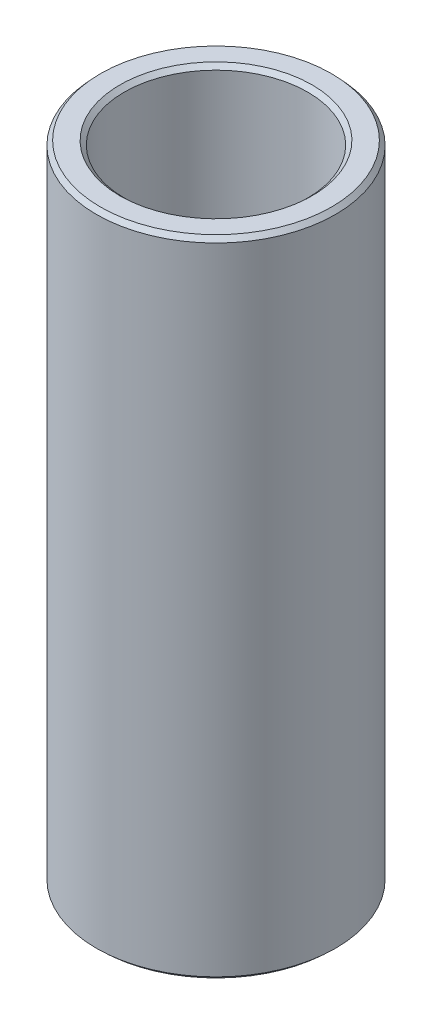
ISO-10303-21;
HEADER;
FILE_DESCRIPTION(('STEP AP214'),'2;1');
FILE_NAME('part.step','',(''),(''),'','','');
FILE_SCHEMA(('AUTOMOTIVE_DESIGN { 1 0 10303 214 1 1 1 1 }'));
ENDSEC;
DATA;
#1=APPLICATION_CONTEXT('core data for automotive mechanical design processes');
#2=APPLICATION_PROTOCOL_DEFINITION('international standard','automotive_design',2000,#1);
#3=PRODUCT_CONTEXT('',#1,'mechanical');
#4=PRODUCT('Part','Part','',(#3));
#5=PRODUCT_RELATED_PRODUCT_CATEGORY('part','',(#4));
#6=PRODUCT_DEFINITION_FORMATION('','',#4);
#7=PRODUCT_DEFINITION_CONTEXT('part definition',#1,'design');
#8=PRODUCT_DEFINITION('design','',#6,#7);
#9=PRODUCT_DEFINITION_SHAPE('','',#8);
#10=(LENGTH_UNIT() NAMED_UNIT(*) SI_UNIT(.MILLI.,.METRE.));
#11=(NAMED_UNIT(*) PLANE_ANGLE_UNIT() SI_UNIT($,.RADIAN.));
#12=(NAMED_UNIT(*) SI_UNIT($,.STERADIAN.) SOLID_ANGLE_UNIT());
#13=UNCERTAINTY_MEASURE_WITH_UNIT(LENGTH_MEASURE(1.E-05),#10,'distance_accuracy_value','');
#14=(GEOMETRIC_REPRESENTATION_CONTEXT(3) GLOBAL_UNCERTAINTY_ASSIGNED_CONTEXT((#13)) GLOBAL_UNIT_ASSIGNED_CONTEXT((#10,
#11,#12)) REPRESENTATION_CONTEXT('',''));
#15=CARTESIAN_POINT('',(0.,0.,0.));
#16=DIRECTION('',(0.,0.,1.));
#17=DIRECTION('',(1.,0.,0.));
#18=AXIS2_PLACEMENT_3D('',#15,#16,#17);
#19=CARTESIAN_POINT('',(0.,148.090437765259,0.));
#20=DIRECTION('',(0.,-1.,0.));
#21=DIRECTION('',(0.,0.,-1.));
#22=AXIS2_PLACEMENT_3D('',#19,#20,#21);
#23=CYLINDRICAL_SURFACE('',#22,27.5);
#24=CARTESIAN_POINT('',(0.,0.931218711199749,0.));
#25=DIRECTION('',(0.,1.,0.));
#26=DIRECTION('',(0.,0.,1.));
#27=AXIS2_PLACEMENT_3D('',#24,#25,#26);
#28=CIRCLE('',#27,27.5);
#29=CARTESIAN_POINT('',(0.,0.931218711199722,-27.5));
#30=VERTEX_POINT('',#29);
#31=EDGE_CURVE('E10',#30,#30,#28,.T.);
#32=CARTESIAN_POINT('',(0.,147.079172085588,0.));
#33=DIRECTION('',(0.,1.,0.));
#34=DIRECTION('',(0.,0.,1.));
#35=AXIS2_PLACEMENT_3D('',#32,#33,#34);
#36=CIRCLE('',#35,27.5);
#37=CARTESIAN_POINT('',(0.,147.079172085588,-27.5));
#38=VERTEX_POINT('',#37);
#39=EDGE_CURVE('E50',#38,#38,#36,.F.);
#40=CARTESIAN_POINT('',(0.,0.931218711199722,-27.5));
#41=CARTESIAN_POINT('',(0.,2.45359322551627,-27.5));
#42=CARTESIAN_POINT('',(0.,3.97596773983281,-27.5));
#43=CARTESIAN_POINT('',(0.,7.0207167684659,-27.5));
#44=CARTESIAN_POINT('',(0.,8.54309128278245,-27.5));
#45=CARTESIAN_POINT('',(0.,11.5878403114155,-27.5));
#46=CARTESIAN_POINT('',(0.,13.1102148257321,-27.5));
#47=CARTESIAN_POINT('',(0.,16.1549638543651,-27.5));
#48=CARTESIAN_POINT('',(0.,17.6773383686817,-27.5));
#49=CARTESIAN_POINT('',(0.,20.7220873973148,-27.5));
#50=CARTESIAN_POINT('',(0.,22.2444619116313,-27.5));
#51=CARTESIAN_POINT('',(0.,25.2892109402644,-27.5));
#52=CARTESIAN_POINT('',(0.,26.811585454581,-27.5));
#53=CARTESIAN_POINT('',(0.,29.856334483214,-27.5));
#54=CARTESIAN_POINT('',(0.,31.3787089975306,-27.5));
#55=CARTESIAN_POINT('',(0.,34.4234580261637,-27.5));
#56=CARTESIAN_POINT('',(0.,35.9458325404802,-27.5));
#57=CARTESIAN_POINT('',(0.,38.9905815691133,-27.5));
#58=CARTESIAN_POINT('',(0.,40.5129560834298,-27.5));
#59=CARTESIAN_POINT('',(0.,43.5577051120629,-27.5));
#60=CARTESIAN_POINT('',(0.,45.0800796263795,-27.5));
#61=CARTESIAN_POINT('',(0.,48.1248286550126,-27.5));
#62=CARTESIAN_POINT('',(0.,49.6472031693291,-27.5));
#63=CARTESIAN_POINT('',(0.,52.6919521979622,-27.5));
#64=CARTESIAN_POINT('',(0.,54.2143267122787,-27.5));
#65=CARTESIAN_POINT('',(0.,57.2590757409118,-27.5));
#66=CARTESIAN_POINT('',(0.,58.7814502552284,-27.5));
#67=CARTESIAN_POINT('',(0.,61.8261992838615,-27.5));
#68=CARTESIAN_POINT('',(0.,63.348573798178,-27.5));
#69=CARTESIAN_POINT('',(0.,66.3933228268111,-27.5));
#70=CARTESIAN_POINT('',(0.,67.9156973411276,-27.5));
#71=CARTESIAN_POINT('',(0.,70.9604463697607,-27.5));
#72=CARTESIAN_POINT('',(0.,72.4828208840773,-27.5));
#73=CARTESIAN_POINT('',(0.,75.5275699127103,-27.5));
#74=CARTESIAN_POINT('',(0.,77.0499444270269,-27.5));
#75=CARTESIAN_POINT('',(0.,80.09469345566,-27.5));
#76=CARTESIAN_POINT('',(0.,81.6170679699765,-27.5));
#77=CARTESIAN_POINT('',(0.,84.6618169986096,-27.5));
#78=CARTESIAN_POINT('',(0.,86.1841915129261,-27.5));
#79=CARTESIAN_POINT('',(0.,89.2289405415592,-27.5));
#80=CARTESIAN_POINT('',(0.,90.7513150558758,-27.5));
#81=CARTESIAN_POINT('',(0.,93.7960640845088,-27.5));
#82=CARTESIAN_POINT('',(0.,95.3184385988254,-27.5));
#83=CARTESIAN_POINT('',(0.,98.3631876274585,-27.5));
#84=CARTESIAN_POINT('',(0.,99.885562141775,-27.5));
#85=CARTESIAN_POINT('',(0.,102.930311170408,-27.5));
#86=CARTESIAN_POINT('',(0.,104.452685684725,-27.5));
#87=CARTESIAN_POINT('',(0.,107.497434713358,-27.5));
#88=CARTESIAN_POINT('',(0.,109.019809227674,-27.5));
#89=CARTESIAN_POINT('',(0.,112.064558256307,-27.5));
#90=CARTESIAN_POINT('',(0.,113.586932770624,-27.5));
#91=CARTESIAN_POINT('',(0.,116.631681799257,-27.5));
#92=CARTESIAN_POINT('',(0.,118.154056313574,-27.5));
#93=CARTESIAN_POINT('',(0.,121.198805342207,-27.5));
#94=CARTESIAN_POINT('',(0.,122.721179856523,-27.5));
#95=CARTESIAN_POINT('',(0.,125.765928885156,-27.5));
#96=CARTESIAN_POINT('',(0.,127.288303399473,-27.5));
#97=CARTESIAN_POINT('',(0.,130.333052428106,-27.5));
#98=CARTESIAN_POINT('',(0.,131.855426942422,-27.5));
#99=CARTESIAN_POINT('',(0.,134.900175971056,-27.5));
#100=CARTESIAN_POINT('',(0.,136.422550485372,-27.5));
#101=CARTESIAN_POINT('',(0.,139.467299514005,-27.5));
#102=CARTESIAN_POINT('',(0.,140.989674028322,-27.5));
#103=CARTESIAN_POINT('',(0.,144.034423056955,-27.5));
#104=CARTESIAN_POINT('',(0.,145.556797571271,-27.5));
#105=CARTESIAN_POINT('',(0.,147.079172085588,-27.5));
#106=B_SPLINE_CURVE_WITH_KNOTS('',3,(#40,#41,#42,#43,#44,#45,#46,#47,#48,#49,#50,#51,#52,#53,
#54,#55,#56,#57,#58,#59,#60,#61,#62,#63,#64,#65,#66,#67,#68,#69,#70,#71,#72,#73,#74,#75,#76,#77,
#78,#79,#80,#81,#82,#83,#84,#85,#86,#87,#88,#89,#90,#91,#92,#93,#94,#95,#96,#97,#98,#99,#100,
#101,#102,#103,#104,#105),.UNSPECIFIED.,.F.,.F.,(4,2,2,2,2,2,2,2,2,2,2,2,2,2,2,2,2,2,2,2,2,2,2,
2,2,2,2,2,2,2,2,2,4),(0.,4.56712354294964,9.13424708589927,13.7013706288489,18.2684941717985,
22.8356177147481,27.4027412576978,31.9698648006474,36.536988343597,41.1041118865467,
45.6712354294963,50.2383589724459,54.8054825153956,59.3726060583452,63.9397296012948,
68.5068531442444,73.0739766871941,77.6411002301437,82.2082237730933,86.775347316043,
91.3424708589926,95.9095944019422,100.476717944892,105.043841487841,109.610965030791,
114.178088573741,118.74521211669,123.31233565964,127.87945920259,132.446582745539,
137.013706288489,141.580829831439,146.147953374388),.UNSPECIFIED.);
#107=EDGE_CURVE('BSEAM39',#30,#38,#106,.T.);
#108=ORIENTED_EDGE('',*,*,#31,.T.);
#109=ORIENTED_EDGE('',*,*,#39,.T.);
#110=ORIENTED_EDGE('',*,*,#107,.T.);
#111=ORIENTED_EDGE('',*,*,#107,.F.);
#112=EDGE_LOOP('',(#108,#110,#109,#111));
#113=FACE_BOUND('',#112,.T.);
#114=ADVANCED_FACE('F39',(#113),#23,.T.);
#115=CARTESIAN_POINT('',(0.,148.090437765259,0.));
#116=DIRECTION('',(0.,1.,0.));
#117=DIRECTION('',(0.,0.,1.));
#118=AXIS2_PLACEMENT_3D('',#115,#116,#117);
#119=PLANE('',#118);
#120=CARTESIAN_POINT('',(0.,148.090437765259,0.));
#121=DIRECTION('',(0.,1.,0.));
#122=DIRECTION('',(0.,0.,1.));
#123=AXIS2_PLACEMENT_3D('',#120,#121,#122);
#124=CIRCLE('',#123,22.1052061741957);
#125=CARTESIAN_POINT('',(0.,148.090437765259,22.1052061741957));
#126=VERTEX_POINT('',#125);
#127=EDGE_CURVE('E58',#126,#126,#124,.F.);
#128=ORIENTED_EDGE('',*,*,#127,.T.);
#129=EDGE_LOOP('',(#128));
#130=FACE_BOUND('',#129,.T.);
#131=CARTESIAN_POINT('',(0.,148.090437765259,0.));
#132=DIRECTION('',(0.,1.,0.));
#133=DIRECTION('',(0.,0.,1.));
#134=AXIS2_PLACEMENT_3D('',#131,#132,#133);
#135=CIRCLE('',#134,26.5687812888004);
#136=CARTESIAN_POINT('',(0.,148.090437765259,26.5687812888004));
#137=VERTEX_POINT('',#136);
#138=EDGE_CURVE('E61',#137,#137,#135,.T.);
#139=ORIENTED_EDGE('',*,*,#138,.T.);
#140=EDGE_LOOP('',(#139));
#141=FACE_BOUND('',#140,.T.);
#142=ADVANCED_FACE('F88',(#130,#141),#119,.T.);
#143=CARTESIAN_POINT('',(0.,0.,0.));
#144=DIRECTION('',(0.,1.,0.));
#145=DIRECTION('',(0.,0.,1.));
#146=AXIS2_PLACEMENT_3D('',#143,#144,#145);
#147=PLANE('',#146);
#148=CARTESIAN_POINT('',(0.,0.,0.));
#149=DIRECTION('',(0.,1.,0.));
#150=DIRECTION('',(0.,0.,1.));
#151=AXIS2_PLACEMENT_3D('',#148,#149,#150);
#152=CIRCLE('',#151,22.0251592057236);
#153=CARTESIAN_POINT('',(0.,0.,22.0251592057236));
#154=VERTEX_POINT('',#153);
#155=EDGE_CURVE('E51',#154,#154,#152,.T.);
#156=ORIENTED_EDGE('',*,*,#155,.T.);
#157=EDGE_LOOP('',(#156));
#158=FACE_BOUND('',#157,.T.);
#159=CARTESIAN_POINT('',(0.,0.,0.));
#160=DIRECTION('',(0.,1.,0.));
#161=DIRECTION('',(0.,0.,1.));
#162=AXIS2_PLACEMENT_3D('',#159,#160,#161);
#163=CIRCLE('',#162,26.4887343203282);
#164=CARTESIAN_POINT('',(0.,0.,26.4887343203282));
#165=VERTEX_POINT('',#164);
#166=EDGE_CURVE('E54',#165,#165,#163,.F.);
#167=ORIENTED_EDGE('',*,*,#166,.T.);
#168=EDGE_LOOP('',(#167));
#169=FACE_BOUND('',#168,.T.);
#170=ADVANCED_FACE('F83',(#158,#169),#147,.F.);
#171=CARTESIAN_POINT('',(0.,148.090437765259,0.));
#172=DIRECTION('',(0.,-1.,0.));
#173=DIRECTION('',(0.,0.,-1.));
#174=AXIS2_PLACEMENT_3D('',#171,#172,#173);
#175=CYLINDRICAL_SURFACE('',#174,21.093940494524);
#176=CARTESIAN_POINT('',(0.,147.15921905406,0.));
#177=DIRECTION('',(0.,1.,0.));
#178=DIRECTION('',(0.,0.,1.));
#179=AXIS2_PLACEMENT_3D('',#176,#177,#178);
#180=CIRCLE('',#179,21.093940494524);
#181=CARTESIAN_POINT('',(0.,147.15921905406,-21.093940494524));
#182=VERTEX_POINT('',#181);
#183=EDGE_CURVE('E67',#182,#182,#180,.T.);
#184=CARTESIAN_POINT('',(0.,1.01126567967161,0.));
#185=DIRECTION('',(0.,1.,0.));
#186=DIRECTION('',(0.,0.,1.));
#187=AXIS2_PLACEMENT_3D('',#184,#185,#186);
#188=CIRCLE('',#187,21.093940494524);
#189=CARTESIAN_POINT('',(0.,1.01126567967158,-21.093940494524));
#190=VERTEX_POINT('',#189);
#191=EDGE_CURVE('E69',#190,#190,#188,.F.);
#192=CARTESIAN_POINT('',(0.,147.15921905406,-21.093940494524));
#193=CARTESIAN_POINT('',(0.,145.636844539743,-21.093940494524));
#194=CARTESIAN_POINT('',(0.,144.114470025427,-21.093940494524));
#195=CARTESIAN_POINT('',(0.,141.069720996794,-21.093940494524));
#196=CARTESIAN_POINT('',(0.,139.547346482477,-21.093940494524));
#197=CARTESIAN_POINT('',(0.,136.502597453844,-21.093940494524));
#198=CARTESIAN_POINT('',(0.,134.980222939527,-21.093940494524));
#199=CARTESIAN_POINT('',(0.,131.935473910894,-21.093940494524));
#200=CARTESIAN_POINT('',(0.,130.413099396578,-21.093940494524));
#201=CARTESIAN_POINT('',(0.,127.368350367945,-21.093940494524));
#202=CARTESIAN_POINT('',(0.,125.845975853628,-21.093940494524));
#203=CARTESIAN_POINT('',(0.,122.801226824995,-21.093940494524));
#204=CARTESIAN_POINT('',(0.,121.278852310678,-21.093940494524));
#205=CARTESIAN_POINT('',(0.,118.234103282045,-21.093940494524));
#206=CARTESIAN_POINT('',(0.,116.711728767729,-21.093940494524));
#207=CARTESIAN_POINT('',(0.,113.666979739096,-21.093940494524));
#208=CARTESIAN_POINT('',(0.,112.144605224779,-21.093940494524));
#209=CARTESIAN_POINT('',(0.,109.099856196146,-21.093940494524));
#210=CARTESIAN_POINT('',(0.,107.57748168183,-21.093940494524));
#211=CARTESIAN_POINT('',(0.,104.532732653197,-21.093940494524));
#212=CARTESIAN_POINT('',(0.,103.01035813888,-21.093940494524));
#213=CARTESIAN_POINT('',(0.,99.9656091102469,-21.093940494524));
#214=CARTESIAN_POINT('',(0.,98.4432345959303,-21.093940494524));
#215=CARTESIAN_POINT('',(0.,95.3984855672973,-21.093940494524));
#216=CARTESIAN_POINT('',(0.,93.8761110529807,-21.093940494524));
#217=CARTESIAN_POINT('',(0.,90.8313620243476,-21.093940494524));
#218=CARTESIAN_POINT('',(0.,89.3089875100311,-21.093940494524));
#219=CARTESIAN_POINT('',(0.,86.264238481398,-21.093940494524));
#220=CARTESIAN_POINT('',(0.,84.7418639670814,-21.093940494524));
#221=CARTESIAN_POINT('',(0.,81.6971149384484,-21.093940494524));
#222=CARTESIAN_POINT('',(0.,80.1747404241318,-21.093940494524));
#223=CARTESIAN_POINT('',(0.,77.1299913954987,-21.093940494524));
#224=CARTESIAN_POINT('',(0.,75.6076168811822,-21.093940494524));
#225=CARTESIAN_POINT('',(0.,72.5628678525491,-21.093940494524));
#226=CARTESIAN_POINT('',(0.,71.0404933382326,-21.093940494524));
#227=CARTESIAN_POINT('',(0.,67.9957443095995,-21.093940494524));
#228=CARTESIAN_POINT('',(0.,66.4733697952829,-21.093940494524));
#229=CARTESIAN_POINT('',(0.,63.4286207666498,-21.093940494524));
#230=CARTESIAN_POINT('',(0.,61.9062462523333,-21.093940494524));
#231=CARTESIAN_POINT('',(0.,58.8614972237002,-21.093940494524));
#232=CARTESIAN_POINT('',(0.,57.3391227093837,-21.093940494524));
#233=CARTESIAN_POINT('',(0.,54.2943736807506,-21.093940494524));
#234=CARTESIAN_POINT('',(0.,52.771999166434,-21.093940494524));
#235=CARTESIAN_POINT('',(0.,49.7272501378009,-21.093940494524));
#236=CARTESIAN_POINT('',(0.,48.2048756234844,-21.093940494524));
#237=CARTESIAN_POINT('',(0.,45.1601265948513,-21.093940494524));
#238=CARTESIAN_POINT('',(0.,43.6377520805348,-21.093940494524));
#239=CARTESIAN_POINT('',(0.,40.5930030519017,-21.093940494524));
#240=CARTESIAN_POINT('',(0.,39.0706285375851,-21.093940494524));
#241=CARTESIAN_POINT('',(0.,36.0258795089521,-21.093940494524));
#242=CARTESIAN_POINT('',(0.,34.5035049946355,-21.093940494524));
#243=CARTESIAN_POINT('',(0.,31.4587559660024,-21.093940494524));
#244=CARTESIAN_POINT('',(0.,29.9363814516859,-21.093940494524));
#245=CARTESIAN_POINT('',(0.,26.8916324230528,-21.093940494524));
#246=CARTESIAN_POINT('',(0.,25.3692579087362,-21.093940494524));
#247=CARTESIAN_POINT('',(0.,22.3245088801032,-21.093940494524));
#248=CARTESIAN_POINT('',(0.,20.8021343657866,-21.093940494524));
#249=CARTESIAN_POINT('',(0.,17.7573853371535,-21.093940494524));
#250=CARTESIAN_POINT('',(0.,16.235010822837,-21.093940494524));
#251=CARTESIAN_POINT('',(0.,13.1902617942039,-21.093940494524));
#252=CARTESIAN_POINT('',(0.,11.6678872798874,-21.093940494524));
#253=CARTESIAN_POINT('',(0.,8.62313825125431,-21.093940494524));
#254=CARTESIAN_POINT('',(0.,7.10076373693776,-21.093940494524));
#255=CARTESIAN_POINT('',(0.,4.05601470830467,-21.093940494524));
#256=CARTESIAN_POINT('',(0.,2.53364019398813,-21.093940494524));
#257=CARTESIAN_POINT('',(0.,1.01126567967158,-21.093940494524));
#258=B_SPLINE_CURVE_WITH_KNOTS('',3,(#192,#193,#194,#195,#196,#197,#198,#199,#200,#201,#202,
#203,#204,#205,#206,#207,#208,#209,#210,#211,#212,#213,#214,#215,#216,#217,#218,#219,#220,#221,
#222,#223,#224,#225,#226,#227,#228,#229,#230,#231,#232,#233,#234,#235,#236,#237,#238,#239,#240,
#241,#242,#243,#244,#245,#246,#247,#248,#249,#250,#251,#252,#253,#254,#255,#256,#257),
.UNSPECIFIED.,.F.,.F.,(4,2,2,2,2,2,2,2,2,2,2,2,2,2,2,2,2,2,2,2,2,2,2,2,2,2,2,2,2,2,2,2,4),(0.,
4.56712354294964,9.13424708589927,13.7013706288489,18.2684941717985,22.8356177147482,
27.4027412576978,31.9698648006474,36.5369883435971,41.1041118865467,45.6712354294963,
50.2383589724459,54.8054825153956,59.3726060583452,63.9397296012948,68.5068531442445,
73.0739766871941,77.6411002301437,82.2082237730934,86.775347316043,91.3424708589926,
95.9095944019422,100.476717944892,105.043841487842,109.610965030791,114.178088573741,
118.74521211669,123.31233565964,127.87945920259,132.446582745539,137.013706288489,
141.580829831439,146.147953374388),.UNSPECIFIED.);
#259=EDGE_CURVE('BSEAM71',#182,#190,#258,.T.);
#260=ORIENTED_EDGE('',*,*,#183,.T.);
#261=ORIENTED_EDGE('',*,*,#191,.T.);
#262=ORIENTED_EDGE('',*,*,#259,.T.);
#263=ORIENTED_EDGE('',*,*,#259,.F.);
#264=EDGE_LOOP('',(#260,#262,#261,#263));
#265=FACE_BOUND('',#264,.T.);
#266=ADVANCED_FACE('F71',(#265),#175,.F.);
#267=CARTESIAN_POINT('',(0.,147.15921905406,0.));
#268=DIRECTION('',(0.,1.,0.));
#269=DIRECTION('',(0.,0.,1.));
#270=AXIS2_PLACEMENT_3D('',#267,#268,#269);
#271=CONICAL_SURFACE('',#270,21.093940494524,0.826583412819373);
#272=ORIENTED_EDGE('',*,*,#127,.F.);
#273=EDGE_LOOP('',(#272));
#274=FACE_BOUND('',#273,.T.);
#275=ORIENTED_EDGE('',*,*,#183,.F.);
#276=EDGE_LOOP('',(#275));
#277=FACE_BOUND('',#276,.T.);
#278=ADVANCED_FACE('F77',(#274,#277),#271,.F.);
#279=CARTESIAN_POINT('',(0.,0.,0.));
#280=DIRECTION('',(0.,-1.,0.));
#281=DIRECTION('',(0.,0.,-1.));
#282=AXIS2_PLACEMENT_3D('',#279,#280,#281);
#283=CONICAL_SURFACE('',#282,22.0251592057236,0.744212913975491);
#284=ORIENTED_EDGE('',*,*,#191,.F.);
#285=EDGE_LOOP('',(#284));
#286=FACE_BOUND('',#285,.T.);
#287=ORIENTED_EDGE('',*,*,#155,.F.);
#288=EDGE_LOOP('',(#287));
#289=FACE_BOUND('',#288,.T.);
#290=ADVANCED_FACE('F73',(#286,#289),#283,.F.);
#291=CARTESIAN_POINT('',(0.,0.931218711199749,0.));
#292=DIRECTION('',(0.,1.,0.));
#293=DIRECTION('',(0.,0.,1.));
#294=AXIS2_PLACEMENT_3D('',#291,#292,#293);
#295=CONICAL_SURFACE('',#294,27.5,0.826583412819403);
#296=ORIENTED_EDGE('',*,*,#166,.F.);
#297=EDGE_LOOP('',(#296));
#298=FACE_BOUND('',#297,.T.);
#299=ORIENTED_EDGE('',*,*,#31,.F.);
#300=EDGE_LOOP('',(#299));
#301=FACE_BOUND('',#300,.T.);
#302=ADVANCED_FACE('F76',(#298,#301),#295,.T.);
#303=CARTESIAN_POINT('',(0.,148.090437765259,0.));
#304=DIRECTION('',(0.,-1.,0.));
#305=DIRECTION('',(0.,0.,-1.));
#306=AXIS2_PLACEMENT_3D('',#303,#304,#305);
#307=CONICAL_SURFACE('',#306,26.5687812888004,0.744212913975507);
#308=ORIENTED_EDGE('',*,*,#39,.F.);
#309=EDGE_LOOP('',(#308));
#310=FACE_BOUND('',#309,.T.);
#311=ORIENTED_EDGE('',*,*,#138,.F.);
#312=EDGE_LOOP('',(#311));
#313=FACE_BOUND('',#312,.T.);
#314=ADVANCED_FACE('F45',(#310,#313),#307,.T.);
#315=CLOSED_SHELL('',(#114,#142,#170,#266,#278,#290,#302,#314));
#316=MANIFOLD_SOLID_BREP('B2',#315);
#317=ADVANCED_BREP_SHAPE_REPRESENTATION('',(#18,#316),#14);
#318=SHAPE_DEFINITION_REPRESENTATION(#9,#317);
ENDSEC;
END-ISO-10303-21;
